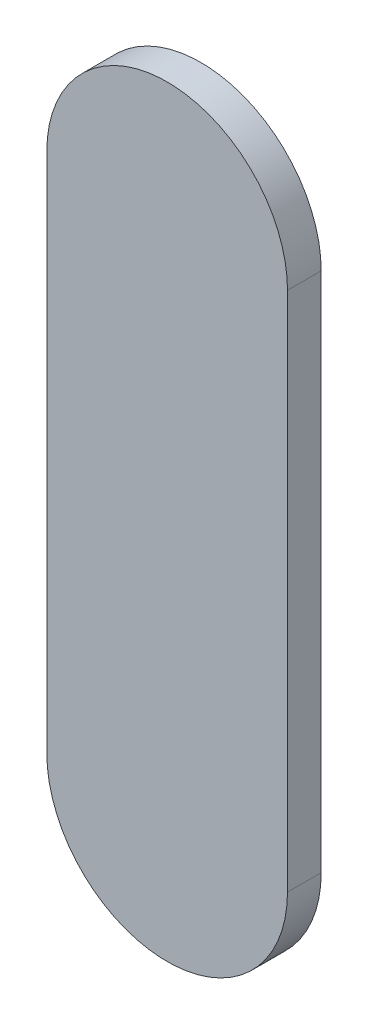
ISO-10303-21;
HEADER;
FILE_DESCRIPTION(('STEP AP214'),'2;1');
FILE_NAME('part.step','',(''),(''),'','','');
FILE_SCHEMA(('AUTOMOTIVE_DESIGN { 1 0 10303 214 1 1 1 1 }'));
ENDSEC;
DATA;
#1=APPLICATION_CONTEXT('core data for automotive mechanical design processes');
#2=APPLICATION_PROTOCOL_DEFINITION('international standard','automotive_design',2000,#1);
#3=PRODUCT_CONTEXT('',#1,'mechanical');
#4=PRODUCT('Part','Part','',(#3));
#5=PRODUCT_RELATED_PRODUCT_CATEGORY('part','',(#4));
#6=PRODUCT_DEFINITION_FORMATION('','',#4);
#7=PRODUCT_DEFINITION_CONTEXT('part definition',#1,'design');
#8=PRODUCT_DEFINITION('design','',#6,#7);
#9=PRODUCT_DEFINITION_SHAPE('','',#8);
#10=(LENGTH_UNIT() NAMED_UNIT(*) SI_UNIT(.MILLI.,.METRE.));
#11=(NAMED_UNIT(*) PLANE_ANGLE_UNIT() SI_UNIT($,.RADIAN.));
#12=(NAMED_UNIT(*) SI_UNIT($,.STERADIAN.) SOLID_ANGLE_UNIT());
#13=UNCERTAINTY_MEASURE_WITH_UNIT(LENGTH_MEASURE(1.E-05),#10,'distance_accuracy_value','');
#14=(GEOMETRIC_REPRESENTATION_CONTEXT(3) GLOBAL_UNCERTAINTY_ASSIGNED_CONTEXT((#13)) GLOBAL_UNIT_ASSIGNED_CONTEXT((#10,
#11,#12)) REPRESENTATION_CONTEXT('',''));
#15=CARTESIAN_POINT('',(0.,0.,0.));
#16=DIRECTION('',(0.,0.,1.));
#17=DIRECTION('',(1.,0.,0.));
#18=AXIS2_PLACEMENT_3D('',#15,#16,#17);
#19=CARTESIAN_POINT('',(100.24397274,84.33694334,0.));
#20=DIRECTION('',(-1.,0.,0.));
#21=DIRECTION('',(0.,1.,0.));
#22=AXIS2_PLACEMENT_3D('',#19,#20,#21);
#23=PLANE('',#22);
#24=DIRECTION('',(0.,1.,0.));
#25=VECTOR('',#24,1.);
#26=CARTESIAN_POINT('',(100.24397274,84.33694334,0.03556));
#27=LINE('',#26,#25);
#28=CARTESIAN_POINT('',(100.24397274,84.33694334,0.03556));
#29=VERTEX_POINT('',#28);
#30=CARTESIAN_POINT('',(100.24397274,84.88697272,0.03556));
#31=VERTEX_POINT('',#30);
#32=EDGE_CURVE('E11',#29,#31,#27,.T.);
#33=ORIENTED_EDGE('',*,*,#32,.F.);
#34=DIRECTION('',(0.,0.,1.));
#35=VECTOR('',#34,1.);
#36=CARTESIAN_POINT('',(100.24397274,84.33694334,0.));
#37=LINE('',#36,#35);
#38=CARTESIAN_POINT('',(100.24397274,84.33694334,0.));
#39=VERTEX_POINT('',#38);
#40=EDGE_CURVE('E24',#39,#29,#37,.T.);
#41=ORIENTED_EDGE('',*,*,#40,.F.);
#42=DIRECTION('',(0.,1.,0.));
#43=VECTOR('',#42,1.);
#44=CARTESIAN_POINT('',(100.24397274,84.33694334,0.));
#45=LINE('',#44,#43);
#46=CARTESIAN_POINT('',(100.24397274,84.88697272,0.));
#47=VERTEX_POINT('',#46);
#48=EDGE_CURVE('E75',#39,#47,#45,.T.);
#49=ORIENTED_EDGE('',*,*,#48,.T.);
#50=DIRECTION('',(0.,0.,1.));
#51=VECTOR('',#50,1.);
#52=CARTESIAN_POINT('',(100.24397274,84.88697272,0.));
#53=LINE('',#52,#51);
#54=EDGE_CURVE('E37',#47,#31,#53,.T.);
#55=ORIENTED_EDGE('',*,*,#54,.T.);
#56=EDGE_LOOP('',(#33,#41,#49,#55));
#57=FACE_BOUND('',#56,.T.);
#58=ADVANCED_FACE('F17',(#57),#23,.F.);
#59=CARTESIAN_POINT('',(100.11697274,84.88697272,0.));
#60=DIRECTION('',(0.,0.,-1.));
#61=DIRECTION('',(1.,1.1189649382048E-13,0.));
#62=AXIS2_PLACEMENT_3D('',#59,#60,#61);
#63=CYLINDRICAL_SURFACE('',#62,0.127000000000005);
#64=CARTESIAN_POINT('',(100.11697274,84.88697272,0.03556));
#65=DIRECTION('',(0.,0.,1.));
#66=DIRECTION('',(1.,1.1189649382048E-13,0.));
#67=AXIS2_PLACEMENT_3D('',#64,#65,#66);
#68=CIRCLE('',#67,0.127000000000005);
#69=CARTESIAN_POINT('',(99.98997274,84.88697272,0.03556));
#70=VERTEX_POINT('',#69);
#71=EDGE_CURVE('E83',#31,#70,#68,.T.);
#72=ORIENTED_EDGE('',*,*,#71,.F.);
#73=ORIENTED_EDGE('',*,*,#54,.F.);
#74=CARTESIAN_POINT('',(100.11697274,84.88697272,0.));
#75=DIRECTION('',(0.,0.,1.));
#76=DIRECTION('',(1.,1.1189649382048E-13,0.));
#77=AXIS2_PLACEMENT_3D('',#74,#75,#76);
#78=CIRCLE('',#77,0.127000000000005);
#79=CARTESIAN_POINT('',(99.98997274,84.88697272,0.));
#80=VERTEX_POINT('',#79);
#81=EDGE_CURVE('E81',#47,#80,#78,.T.);
#82=ORIENTED_EDGE('',*,*,#81,.T.);
#83=DIRECTION('',(0.,0.,1.));
#84=VECTOR('',#83,1.);
#85=CARTESIAN_POINT('',(99.98997274,84.88697272,0.));
#86=LINE('',#85,#84);
#87=EDGE_CURVE('E67',#80,#70,#86,.T.);
#88=ORIENTED_EDGE('',*,*,#87,.T.);
#89=EDGE_LOOP('',(#72,#73,#82,#88));
#90=FACE_BOUND('',#89,.T.);
#91=ADVANCED_FACE('F89',(#90),#63,.T.);
#92=CARTESIAN_POINT('',(99.98997274,84.88697272,0.));
#93=DIRECTION('',(1.,0.,0.));
#94=DIRECTION('',(0.,-1.,0.));
#95=AXIS2_PLACEMENT_3D('',#92,#93,#94);
#96=PLANE('',#95);
#97=DIRECTION('',(0.,-1.,0.));
#98=VECTOR('',#97,1.);
#99=CARTESIAN_POINT('',(99.98997274,84.88697272,0.03556));
#100=LINE('',#99,#98);
#101=CARTESIAN_POINT('',(99.98997274,84.33694334,0.03556));
#102=VERTEX_POINT('',#101);
#103=EDGE_CURVE('E71',#70,#102,#100,.T.);
#104=ORIENTED_EDGE('',*,*,#103,.F.);
#105=ORIENTED_EDGE('',*,*,#87,.F.);
#106=DIRECTION('',(0.,-1.,0.));
#107=VECTOR('',#106,1.);
#108=CARTESIAN_POINT('',(99.98997274,84.88697272,0.));
#109=LINE('',#108,#107);
#110=CARTESIAN_POINT('',(99.98997274,84.33694334,0.));
#111=VERTEX_POINT('',#110);
#112=EDGE_CURVE('E63',#80,#111,#109,.T.);
#113=ORIENTED_EDGE('',*,*,#112,.T.);
#114=DIRECTION('',(0.,0.,1.));
#115=VECTOR('',#114,1.);
#116=CARTESIAN_POINT('',(99.98997274,84.33694334,0.));
#117=LINE('',#116,#115);
#118=EDGE_CURVE('E53',#111,#102,#117,.T.);
#119=ORIENTED_EDGE('',*,*,#118,.T.);
#120=EDGE_LOOP('',(#104,#105,#113,#119));
#121=FACE_BOUND('',#120,.T.);
#122=ADVANCED_FACE('F66',(#121),#96,.F.);
#123=CARTESIAN_POINT('',(100.11697274,84.33694334,0.));
#124=DIRECTION('',(0.,0.,-1.));
#125=DIRECTION('',(-1.,0.,0.));
#126=AXIS2_PLACEMENT_3D('',#123,#124,#125);
#127=CYLINDRICAL_SURFACE('',#126,0.127000000000005);
#128=CARTESIAN_POINT('',(100.11697274,84.33694334,0.03556));
#129=DIRECTION('',(0.,0.,1.));
#130=DIRECTION('',(-1.,0.,0.));
#131=AXIS2_PLACEMENT_3D('',#128,#129,#130);
#132=CIRCLE('',#131,0.127000000000005);
#133=EDGE_CURVE('E59',#102,#29,#132,.T.);
#134=ORIENTED_EDGE('',*,*,#133,.F.);
#135=ORIENTED_EDGE('',*,*,#118,.F.);
#136=CARTESIAN_POINT('',(100.11697274,84.33694334,0.));
#137=DIRECTION('',(0.,0.,1.));
#138=DIRECTION('',(-1.,0.,0.));
#139=AXIS2_PLACEMENT_3D('',#136,#137,#138);
#140=CIRCLE('',#139,0.127000000000005);
#141=EDGE_CURVE('E57',#111,#39,#140,.T.);
#142=ORIENTED_EDGE('',*,*,#141,.T.);
#143=ORIENTED_EDGE('',*,*,#40,.T.);
#144=EDGE_LOOP('',(#134,#135,#142,#143));
#145=FACE_BOUND('',#144,.T.);
#146=ADVANCED_FACE('F55',(#145),#127,.T.);
#147=CARTESIAN_POINT('',(100.24397274,84.33694334,0.));
#148=DIRECTION('',(0.,0.,-1.));
#149=DIRECTION('',(-1.,0.,0.));
#150=AXIS2_PLACEMENT_3D('',#147,#148,#149);
#151=PLANE('',#150);
#152=ORIENTED_EDGE('',*,*,#141,.F.);
#153=ORIENTED_EDGE('',*,*,#112,.F.);
#154=ORIENTED_EDGE('',*,*,#81,.F.);
#155=ORIENTED_EDGE('',*,*,#48,.F.);
#156=EDGE_LOOP('',(#152,#153,#154,#155));
#157=FACE_BOUND('',#156,.T.);
#158=ADVANCED_FACE('F74',(#157),#151,.T.);
#159=CARTESIAN_POINT('',(100.24397274,84.33694334,0.03556));
#160=DIRECTION('',(0.,0.,-1.));
#161=DIRECTION('',(-1.,0.,0.));
#162=AXIS2_PLACEMENT_3D('',#159,#160,#161);
#163=PLANE('',#162);
#164=ORIENTED_EDGE('',*,*,#32,.T.);
#165=ORIENTED_EDGE('',*,*,#71,.T.);
#166=ORIENTED_EDGE('',*,*,#103,.T.);
#167=ORIENTED_EDGE('',*,*,#133,.T.);
#168=EDGE_LOOP('',(#164,#165,#166,#167));
#169=FACE_BOUND('',#168,.T.);
#170=ADVANCED_FACE('F91',(#169),#163,.F.);
#171=CLOSED_SHELL('',(#58,#91,#122,#146,#158,#170));
#172=MANIFOLD_SOLID_BREP('B1',#171);
#173=ADVANCED_BREP_SHAPE_REPRESENTATION('',(#18,#172),#14);
#174=SHAPE_DEFINITION_REPRESENTATION(#9,#173);
ENDSEC;
END-ISO-10303-21;
